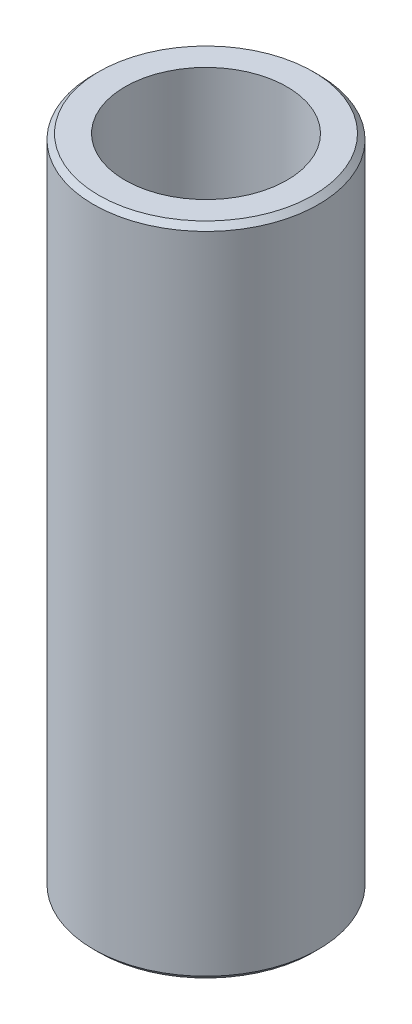
ISO-10303-21;
HEADER;
FILE_DESCRIPTION(('STEP AP214'),'2;1');
FILE_NAME('part.step','',(''),(''),'','','');
FILE_SCHEMA(('AUTOMOTIVE_DESIGN { 1 0 10303 214 1 1 1 1 }'));
ENDSEC;
DATA;
#1=APPLICATION_CONTEXT('core data for automotive mechanical design processes');
#2=APPLICATION_PROTOCOL_DEFINITION('international standard','automotive_design',2000,#1);
#3=PRODUCT_CONTEXT('',#1,'mechanical');
#4=PRODUCT('Part','Part','',(#3));
#5=PRODUCT_RELATED_PRODUCT_CATEGORY('part','',(#4));
#6=PRODUCT_DEFINITION_FORMATION('','',#4);
#7=PRODUCT_DEFINITION_CONTEXT('part definition',#1,'design');
#8=PRODUCT_DEFINITION('design','',#6,#7);
#9=PRODUCT_DEFINITION_SHAPE('','',#8);
#10=(LENGTH_UNIT() NAMED_UNIT(*) SI_UNIT(.MILLI.,.METRE.));
#11=(NAMED_UNIT(*) PLANE_ANGLE_UNIT() SI_UNIT($,.RADIAN.));
#12=(NAMED_UNIT(*) SI_UNIT($,.STERADIAN.) SOLID_ANGLE_UNIT());
#13=UNCERTAINTY_MEASURE_WITH_UNIT(LENGTH_MEASURE(1.E-05),#10,'distance_accuracy_value','');
#14=(GEOMETRIC_REPRESENTATION_CONTEXT(3) GLOBAL_UNCERTAINTY_ASSIGNED_CONTEXT((#13)) GLOBAL_UNIT_ASSIGNED_CONTEXT((#10,
#11,#12)) REPRESENTATION_CONTEXT('',''));
#15=CARTESIAN_POINT('',(0.,0.,0.));
#16=DIRECTION('',(0.,0.,1.));
#17=DIRECTION('',(1.,0.,0.));
#18=AXIS2_PLACEMENT_3D('',#15,#16,#17);
#19=CARTESIAN_POINT('',(0.,349.753377044499,0.));
#20=DIRECTION('',(0.,-1.,0.));
#21=DIRECTION('',(0.,0.,-1.));
#22=AXIS2_PLACEMENT_3D('',#19,#20,#21);
#23=CYLINDRICAL_SURFACE('',#22,60.);
#24=CARTESIAN_POINT('',(0.,346.916820898786,0.));
#25=DIRECTION('',(0.,1.,0.));
#26=DIRECTION('',(0.,0.,1.));
#27=AXIS2_PLACEMENT_3D('',#24,#25,#26);
#28=CIRCLE('',#27,60.);
#29=CARTESIAN_POINT('',(0.,346.916820898786,60.));
#30=VERTEX_POINT('',#29);
#31=EDGE_CURVE('E50',#30,#30,#28,.F.);
#32=ORIENTED_EDGE('',*,*,#31,.T.);
#33=EDGE_LOOP('',(#32));
#34=FACE_BOUND('',#33,.T.);
#35=CARTESIAN_POINT('',(0.,2.83655614571293,0.));
#36=DIRECTION('',(0.,1.,0.));
#37=DIRECTION('',(0.,0.,1.));
#38=AXIS2_PLACEMENT_3D('',#35,#36,#37);
#39=CIRCLE('',#38,60.);
#40=CARTESIAN_POINT('',(0.,2.83655614571293,60.));
#41=VERTEX_POINT('',#40);
#42=EDGE_CURVE('E51',#41,#41,#39,.T.);
#43=ORIENTED_EDGE('',*,*,#42,.T.);
#44=EDGE_LOOP('',(#43));
#45=FACE_BOUND('',#44,.T.);
#46=ADVANCED_FACE('F39',(#34,#45),#23,.T.);
#47=CARTESIAN_POINT('',(0.,349.753377044499,0.));
#48=DIRECTION('',(0.,1.,0.));
#49=DIRECTION('',(0.,0.,1.));
#50=AXIS2_PLACEMENT_3D('',#47,#48,#49);
#51=PLANE('',#50);
#52=CARTESIAN_POINT('',(0.,349.753377044499,0.));
#53=DIRECTION('',(0.,1.,0.));
#54=DIRECTION('',(0.,0.,1.));
#55=AXIS2_PLACEMENT_3D('',#52,#53,#54);
#56=CIRCLE('',#55,57.163443854287);
#57=CARTESIAN_POINT('',(0.,349.753377044499,57.163443854287));
#58=VERTEX_POINT('',#57);
#59=EDGE_CURVE('E54',#58,#58,#56,.T.);
#60=ORIENTED_EDGE('',*,*,#59,.T.);
#61=EDGE_LOOP('',(#60));
#62=FACE_BOUND('',#61,.T.);
#63=CARTESIAN_POINT('',(0.,349.753377044499,0.));
#64=DIRECTION('',(0.,1.,0.));
#65=DIRECTION('',(0.,0.,1.));
#66=AXIS2_PLACEMENT_3D('',#63,#64,#65);
#67=CIRCLE('',#66,43.1967096967432);
#68=CARTESIAN_POINT('',(0.,349.753377044499,43.1967096967432));
#69=VERTEX_POINT('',#68);
#70=EDGE_CURVE('E58',#69,#69,#67,.T.);
#71=ORIENTED_EDGE('',*,*,#70,.F.);
#72=EDGE_LOOP('',(#71));
#73=FACE_BOUND('',#72,.T.);
#74=ADVANCED_FACE('F69',(#62,#73),#51,.T.);
#75=CARTESIAN_POINT('',(0.,0.,0.));
#76=DIRECTION('',(0.,1.,0.));
#77=DIRECTION('',(0.,0.,1.));
#78=AXIS2_PLACEMENT_3D('',#75,#76,#77);
#79=PLANE('',#78);
#80=CARTESIAN_POINT('',(0.,0.,0.));
#81=DIRECTION('',(0.,1.,0.));
#82=DIRECTION('',(0.,0.,1.));
#83=AXIS2_PLACEMENT_3D('',#80,#81,#82);
#84=CIRCLE('',#83,57.163443854287);
#85=CARTESIAN_POINT('',(0.,0.,57.163443854287));
#86=VERTEX_POINT('',#85);
#87=EDGE_CURVE('E10',#86,#86,#84,.F.);
#88=ORIENTED_EDGE('',*,*,#87,.T.);
#89=EDGE_LOOP('',(#88));
#90=FACE_BOUND('',#89,.T.);
#91=CARTESIAN_POINT('',(0.,0.,0.));
#92=DIRECTION('',(0.,1.,0.));
#93=DIRECTION('',(0.,0.,1.));
#94=AXIS2_PLACEMENT_3D('',#91,#92,#93);
#95=CIRCLE('',#94,43.1967096967432);
#96=CARTESIAN_POINT('',(0.,0.,43.1967096967432));
#97=VERTEX_POINT('',#96);
#98=EDGE_CURVE('E63',#97,#97,#95,.T.);
#99=ORIENTED_EDGE('',*,*,#98,.T.);
#100=EDGE_LOOP('',(#99));
#101=FACE_BOUND('',#100,.T.);
#102=ADVANCED_FACE('F75',(#90,#101),#79,.F.);
#103=CARTESIAN_POINT('',(0.,349.753377044499,0.));
#104=DIRECTION('',(0.,-1.,0.));
#105=DIRECTION('',(0.,0.,-1.));
#106=AXIS2_PLACEMENT_3D('',#103,#104,#105);
#107=CYLINDRICAL_SURFACE('',#106,43.1967096967432);
#108=ORIENTED_EDGE('',*,*,#70,.T.);
#109=EDGE_LOOP('',(#108));
#110=FACE_BOUND('',#109,.T.);
#111=ORIENTED_EDGE('',*,*,#98,.F.);
#112=EDGE_LOOP('',(#111));
#113=FACE_BOUND('',#112,.T.);
#114=ADVANCED_FACE('F70',(#110,#113),#107,.F.);
#115=CARTESIAN_POINT('',(0.,349.753377044499,0.));
#116=DIRECTION('',(0.,-1.,0.));
#117=DIRECTION('',(0.,0.,-1.));
#118=AXIS2_PLACEMENT_3D('',#115,#116,#117);
#119=CONICAL_SURFACE('',#118,57.163443854287,0.785398163397447);
#120=ORIENTED_EDGE('',*,*,#31,.F.);
#121=EDGE_LOOP('',(#120));
#122=FACE_BOUND('',#121,.T.);
#123=ORIENTED_EDGE('',*,*,#59,.F.);
#124=EDGE_LOOP('',(#123));
#125=FACE_BOUND('',#124,.T.);
#126=ADVANCED_FACE('F81',(#122,#125),#119,.T.);
#127=CARTESIAN_POINT('',(0.,2.83655614571293,0.));
#128=DIRECTION('',(0.,1.,0.));
#129=DIRECTION('',(0.,0.,1.));
#130=AXIS2_PLACEMENT_3D('',#127,#128,#129);
#131=CONICAL_SURFACE('',#130,60.,0.785398163397458);
#132=CARTESIAN_POINT('',(0.,0.,57.163443854287));
#133=CARTESIAN_POINT('',(0.,0.0295474598511778,57.1929913141382));
#134=CARTESIAN_POINT('',(0.,0.0590949197023535,57.2225387739894));
#135=CARTESIAN_POINT('',(0.,0.118189839404705,57.2816336936917));
#136=CARTESIAN_POINT('',(0.,0.147737299255881,57.3111811535429));
#137=CARTESIAN_POINT('',(0.,0.206832218958234,57.3702760732453));
#138=CARTESIAN_POINT('',(0.,0.236379678809411,57.3998235330964));
#139=CARTESIAN_POINT('',(0.,0.295474598511764,57.4589184527988));
#140=CARTESIAN_POINT('',(0.,0.325022058362939,57.48846591265));
#141=CARTESIAN_POINT('',(0.,0.384116978065292,57.5475608323523));
#142=CARTESIAN_POINT('',(0.,0.413664437916469,57.5771082922035));
#143=CARTESIAN_POINT('',(0.,0.472759357618822,57.6362032119058));
#144=CARTESIAN_POINT('',(0.,0.502306817469997,57.665750671757));
#145=CARTESIAN_POINT('',(0.,0.56140173717235,57.7248455914594));
#146=CARTESIAN_POINT('',(0.,0.590949197023528,57.7543930513105));
#147=CARTESIAN_POINT('',(0.,0.65004411672588,57.8134879710129));
#148=CARTESIAN_POINT('',(0.,0.679591576577055,57.8430354308641));
#149=CARTESIAN_POINT('',(0.,0.738686496279408,57.9021303505664));
#150=CARTESIAN_POINT('',(0.,0.768233956130586,57.9316778104176));
#151=CARTESIAN_POINT('',(0.,0.827328875832938,57.99077273012));
#152=CARTESIAN_POINT('',(0.,0.856876335684114,58.0203201899711));
#153=CARTESIAN_POINT('',(0.,0.915971255386466,58.0794151096735));
#154=CARTESIAN_POINT('',(0.,0.945518715237644,58.1089625695247));
#155=CARTESIAN_POINT('',(0.,1.00461363494,58.168057489227));
#156=CARTESIAN_POINT('',(0.,1.03416109479117,58.1976049490782));
#157=CARTESIAN_POINT('',(0.,1.09325601449352,58.2566998687806));
#158=CARTESIAN_POINT('',(0.,1.1228034743447,58.2862473286317));
#159=CARTESIAN_POINT('',(0.,1.18189839404705,58.3453422483341));
#160=CARTESIAN_POINT('',(0.,1.21144585389823,58.3748897081853));
#161=CARTESIAN_POINT('',(0.,1.27054077360058,58.4339846278876));
#162=CARTESIAN_POINT('',(0.,1.30008823345176,58.4635320877388));
#163=CARTESIAN_POINT('',(0.,1.35918315315411,58.5226270074411));
#164=CARTESIAN_POINT('',(0.,1.38873061300529,58.5521744672923));
#165=CARTESIAN_POINT('',(0.,1.44782553270764,58.6112693869947));
#166=CARTESIAN_POINT('',(0.,1.47737299255882,58.6408168468459));
#167=CARTESIAN_POINT('',(0.,1.53646791226117,58.6999117665482));
#168=CARTESIAN_POINT('',(0.,1.56601537211235,58.7294592263994));
#169=CARTESIAN_POINT('',(0.,1.6251102918147,58.7885541461017));
#170=CARTESIAN_POINT('',(0.,1.65465775166588,58.8181016059529));
#171=CARTESIAN_POINT('',(0.,1.71375267136823,58.8771965256553));
#172=CARTESIAN_POINT('',(0.,1.7433001312194,58.9067439855065));
#173=CARTESIAN_POINT('',(0.,1.80239505092176,58.9658389052088));
#174=CARTESIAN_POINT('',(0.,1.83194251077294,58.99538636506));
#175=CARTESIAN_POINT('',(0.,1.89103743047529,59.0544812847623));
#176=CARTESIAN_POINT('',(0.,1.92058489032646,59.0840287446135));
#177=CARTESIAN_POINT('',(0.,1.97967981002882,59.1431236643159));
#178=CARTESIAN_POINT('',(0.,2.00922726987999,59.172671124167));
#179=CARTESIAN_POINT('',(0.,2.06832218958235,59.2317660438694));
#180=CARTESIAN_POINT('',(0.,2.09786964943352,59.2613135037206));
#181=CARTESIAN_POINT('',(0.,2.15696456913587,59.3204084234229));
#182=CARTESIAN_POINT('',(0.,2.18651202898705,59.3499558832741));
#183=CARTESIAN_POINT('',(0.,2.2456069486894,59.4090508029765));
#184=CARTESIAN_POINT('',(0.,2.27515440854058,59.4385982628276));
#185=CARTESIAN_POINT('',(0.,2.33424932824293,59.49769318253));
#186=CARTESIAN_POINT('',(0.,2.36379678809411,59.5272406423812));
#187=CARTESIAN_POINT('',(0.,2.42289170779646,59.5863355620835));
#188=CARTESIAN_POINT('',(0.,2.45243916764764,59.6158830219347));
#189=CARTESIAN_POINT('',(0.,2.51153408734999,59.6749779416371));
#190=CARTESIAN_POINT('',(0.,2.54108154720117,59.7045254014882));
#191=CARTESIAN_POINT('',(0.,2.60017646690352,59.7636203211906));
#192=CARTESIAN_POINT('',(0.,2.6297239267547,59.7931677810418));
#193=CARTESIAN_POINT('',(0.,2.68881884645705,59.8522627007441));
#194=CARTESIAN_POINT('',(0.,2.71836630630823,59.8818101605953));
#195=CARTESIAN_POINT('',(0.,2.77746122601058,59.9409050802976));
#196=CARTESIAN_POINT('',(0.,2.80700868586176,59.9704525401488));
#197=CARTESIAN_POINT('',(0.,2.83655614571293,60.));
#198=B_SPLINE_CURVE_WITH_KNOTS('',3,(#132,#133,#134,#135,#136,#137,#138,#139,#140,#141,#142,
#143,#144,#145,#146,#147,#148,#149,#150,#151,#152,#153,#154,#155,#156,#157,#158,#159,#160,#161,
#162,#163,#164,#165,#166,#167,#168,#169,#170,#171,#172,#173,#174,#175,#176,#177,#178,#179,#180,
#181,#182,#183,#184,#185,#186,#187,#188,#189,#190,#191,#192,#193,#194,#195,#196,#197),
.UNSPECIFIED.,.F.,.F.,(4,2,2,2,2,2,2,2,2,2,2,2,2,2,2,2,2,2,2,2,2,2,2,2,2,2,2,2,2,2,2,2,4),(0.,
0.125359255365623,0.250718510731251,0.376077766096874,0.501437021462503,0.626796276828126,
0.752155532193754,0.877514787559377,1.00287404292501,1.12823329829063,1.25359255365626,
1.37895180902188,1.50431106438751,1.62967031975313,1.75502957511876,1.88038883048438,
2.00574808585001,2.13110734121563,2.25646659658126,2.38182585194688,2.50718510731251,
2.63254436267814,2.75790361804376,2.88326287340939,3.00862212877502,3.13398138414064,
3.25934063950627,3.38469989487189,3.51005915023752,3.63541840560314,3.76077766096877,
3.88613691633439,4.01149617170002),.UNSPECIFIED.);
#199=EDGE_CURVE('BSEAM45',#86,#41,#198,.T.);
#200=ORIENTED_EDGE('',*,*,#87,.F.);
#201=ORIENTED_EDGE('',*,*,#42,.F.);
#202=ORIENTED_EDGE('',*,*,#199,.T.);
#203=ORIENTED_EDGE('',*,*,#199,.F.);
#204=EDGE_LOOP('',(#200,#202,#201,#203));
#205=FACE_BOUND('',#204,.T.);
#206=ADVANCED_FACE('F45',(#205),#131,.T.);
#207=CLOSED_SHELL('',(#46,#74,#102,#114,#126,#206));
#208=MANIFOLD_SOLID_BREP('B2',#207);
#209=ADVANCED_BREP_SHAPE_REPRESENTATION('',(#18,#208),#14);
#210=SHAPE_DEFINITION_REPRESENTATION(#9,#209);
ENDSEC;
END-ISO-10303-21;
